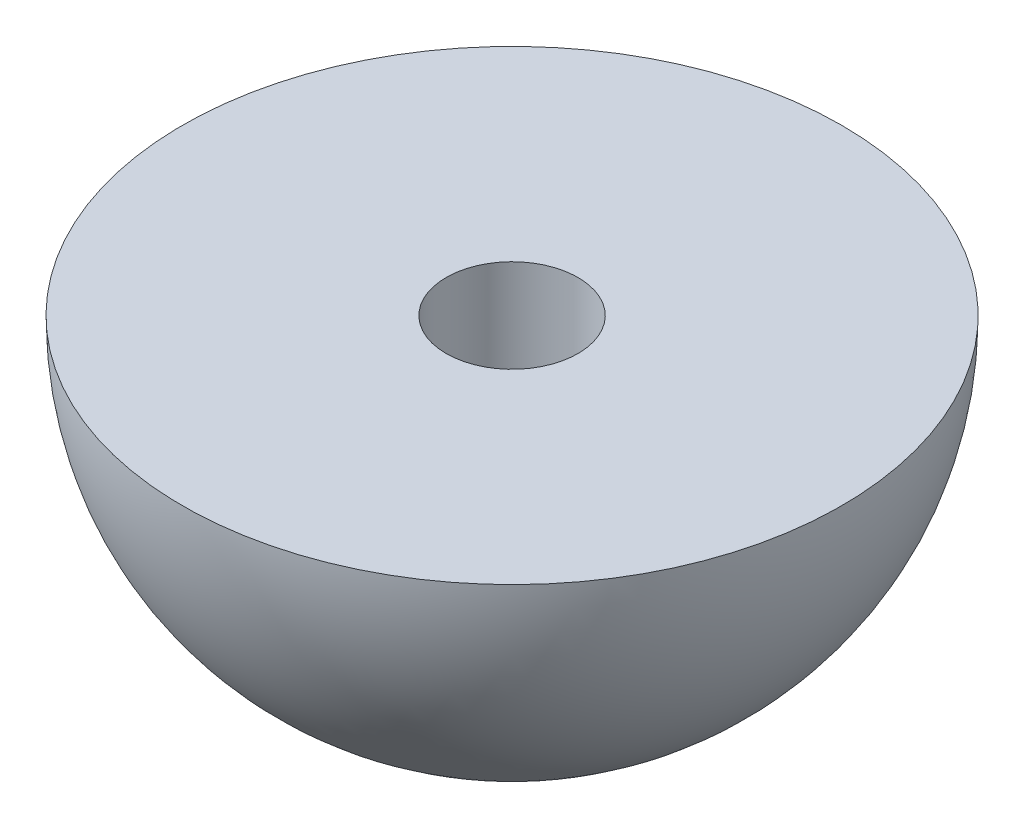
ISO-10303-21;
HEADER;
FILE_DESCRIPTION(('STEP AP214'),'2;1');
FILE_NAME('part.step','',(''),(''),'','','');
FILE_SCHEMA(('AUTOMOTIVE_DESIGN { 1 0 10303 214 1 1 1 1 }'));
ENDSEC;
DATA;
#1=APPLICATION_CONTEXT('core data for automotive mechanical design processes');
#2=APPLICATION_PROTOCOL_DEFINITION('international standard','automotive_design',2000,#1);
#3=PRODUCT_CONTEXT('',#1,'mechanical');
#4=PRODUCT('Part','Part','',(#3));
#5=PRODUCT_RELATED_PRODUCT_CATEGORY('part','',(#4));
#6=PRODUCT_DEFINITION_FORMATION('','',#4);
#7=PRODUCT_DEFINITION_CONTEXT('part definition',#1,'design');
#8=PRODUCT_DEFINITION('design','',#6,#7);
#9=PRODUCT_DEFINITION_SHAPE('','',#8);
#10=(LENGTH_UNIT() NAMED_UNIT(*) SI_UNIT(.MILLI.,.METRE.));
#11=(NAMED_UNIT(*) PLANE_ANGLE_UNIT() SI_UNIT($,.RADIAN.));
#12=(NAMED_UNIT(*) SI_UNIT($,.STERADIAN.) SOLID_ANGLE_UNIT());
#13=UNCERTAINTY_MEASURE_WITH_UNIT(LENGTH_MEASURE(1.E-05),#10,'distance_accuracy_value','');
#14=(GEOMETRIC_REPRESENTATION_CONTEXT(3) GLOBAL_UNCERTAINTY_ASSIGNED_CONTEXT((#13)) GLOBAL_UNIT_ASSIGNED_CONTEXT((#10,
#11,#12)) REPRESENTATION_CONTEXT('',''));
#15=CARTESIAN_POINT('',(0.,0.,0.));
#16=DIRECTION('',(0.,0.,1.));
#17=DIRECTION('',(1.,0.,0.));
#18=AXIS2_PLACEMENT_3D('',#15,#16,#17);
#19=CARTESIAN_POINT('',(0.,0.,0.));
#20=DIRECTION('',(0.,1.,0.));
#21=DIRECTION('',(0.,0.,1.));
#22=AXIS2_PLACEMENT_3D('',#19,#20,#21);
#23=PLANE('',#22);
#24=CARTESIAN_POINT('',(0.,0.,0.));
#25=DIRECTION('',(0.,1.,0.));
#26=DIRECTION('',(0.,0.,1.));
#27=AXIS2_PLACEMENT_3D('',#24,#25,#26);
#28=CIRCLE('',#27,1.6);
#29=CARTESIAN_POINT('',(0.,0.,1.6));
#30=VERTEX_POINT('',#29);
#31=EDGE_CURVE('E43',#30,#30,#28,.T.);
#32=ORIENTED_EDGE('',*,*,#31,.F.);
#33=EDGE_LOOP('',(#32));
#34=FACE_BOUND('',#33,.T.);
#35=CARTESIAN_POINT('',(0.,0.,0.));
#36=DIRECTION('',(0.,-1.,0.));
#37=DIRECTION('',(0.,0.,-1.));
#38=AXIS2_PLACEMENT_3D('',#35,#36,#37);
#39=CIRCLE('',#38,8.);
#40=CARTESIAN_POINT('',(0.,0.,-8.));
#41=VERTEX_POINT('',#40);
#42=EDGE_CURVE('E10',#41,#41,#39,.T.);
#43=ORIENTED_EDGE('',*,*,#42,.F.);
#44=EDGE_LOOP('',(#43));
#45=FACE_BOUND('',#44,.T.);
#46=ADVANCED_FACE('F33',(#34,#45),#23,.T.);
#47=CARTESIAN_POINT('',(0.,0.,0.));
#48=DIRECTION('',(0.,-1.,0.));
#49=DIRECTION('',(-1.,0.,0.));
#50=AXIS2_PLACEMENT_3D('',#47,#48,#49);
#51=SPHERICAL_SURFACE('',#50,8.);
#52=CARTESIAN_POINT('',(0.,-7.83836717690617,0.));
#53=DIRECTION('',(0.,1.,0.));
#54=DIRECTION('',(0.,0.,1.));
#55=AXIS2_PLACEMENT_3D('',#52,#53,#54);
#56=CIRCLE('',#55,1.6);
#57=CARTESIAN_POINT('',(0.,-7.83836717690617,1.6));
#58=VERTEX_POINT('',#57);
#59=EDGE_CURVE('E36',#58,#58,#56,.F.);
#60=ORIENTED_EDGE('',*,*,#59,.F.);
#61=EDGE_LOOP('',(#60));
#62=FACE_BOUND('',#61,.T.);
#63=ORIENTED_EDGE('',*,*,#42,.T.);
#64=EDGE_LOOP('',(#63));
#65=FACE_BOUND('',#64,.T.);
#66=ADVANCED_FACE('F52',(#62,#65),#51,.T.);
#67=CARTESIAN_POINT('',(0.,-8.,0.));
#68=DIRECTION('',(0.,1.,0.));
#69=DIRECTION('',(0.,0.,1.));
#70=AXIS2_PLACEMENT_3D('',#67,#68,#69);
#71=CYLINDRICAL_SURFACE('',#70,1.6);
#72=ORIENTED_EDGE('',*,*,#59,.T.);
#73=EDGE_LOOP('',(#72));
#74=FACE_BOUND('',#73,.T.);
#75=ORIENTED_EDGE('',*,*,#31,.T.);
#76=EDGE_LOOP('',(#75));
#77=FACE_BOUND('',#76,.T.);
#78=ADVANCED_FACE('F48',(#74,#77),#71,.F.);
#79=CLOSED_SHELL('',(#46,#66,#78));
#80=MANIFOLD_SOLID_BREP('B2',#79);
#81=ADVANCED_BREP_SHAPE_REPRESENTATION('',(#18,#80),#14);
#82=SHAPE_DEFINITION_REPRESENTATION(#9,#81);
ENDSEC;
END-ISO-10303-21;
